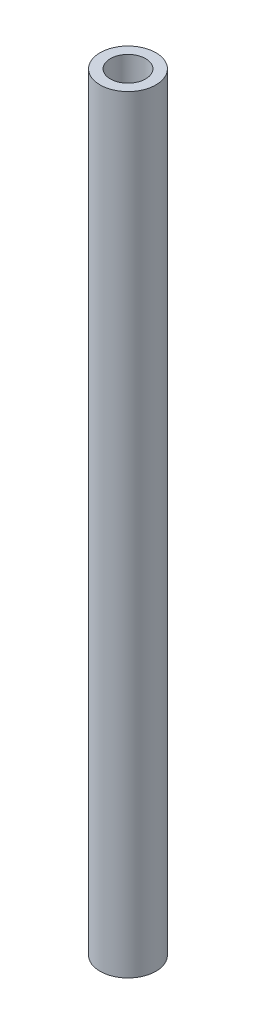
ISO-10303-21;
HEADER;
FILE_DESCRIPTION(('STEP AP214'),'2;1');
FILE_NAME('part.step','',(''),(''),'','','');
FILE_SCHEMA(('AUTOMOTIVE_DESIGN { 1 0 10303 214 1 1 1 1 }'));
ENDSEC;
DATA;
#1=APPLICATION_CONTEXT('core data for automotive mechanical design processes');
#2=APPLICATION_PROTOCOL_DEFINITION('international standard','automotive_design',2000,#1);
#3=PRODUCT_CONTEXT('',#1,'mechanical');
#4=PRODUCT('Part','Part','',(#3));
#5=PRODUCT_RELATED_PRODUCT_CATEGORY('part','',(#4));
#6=PRODUCT_DEFINITION_FORMATION('','',#4);
#7=PRODUCT_DEFINITION_CONTEXT('part definition',#1,'design');
#8=PRODUCT_DEFINITION('design','',#6,#7);
#9=PRODUCT_DEFINITION_SHAPE('','',#8);
#10=(LENGTH_UNIT() NAMED_UNIT(*) SI_UNIT(.MILLI.,.METRE.));
#11=(NAMED_UNIT(*) PLANE_ANGLE_UNIT() SI_UNIT($,.RADIAN.));
#12=(NAMED_UNIT(*) SI_UNIT($,.STERADIAN.) SOLID_ANGLE_UNIT());
#13=UNCERTAINTY_MEASURE_WITH_UNIT(LENGTH_MEASURE(1.E-05),#10,'distance_accuracy_value','');
#14=(GEOMETRIC_REPRESENTATION_CONTEXT(3) GLOBAL_UNCERTAINTY_ASSIGNED_CONTEXT((#13)) GLOBAL_UNIT_ASSIGNED_CONTEXT((#10,
#11,#12)) REPRESENTATION_CONTEXT('',''));
#15=CARTESIAN_POINT('',(0.,0.,0.));
#16=DIRECTION('',(0.,0.,1.));
#17=DIRECTION('',(1.,0.,0.));
#18=AXIS2_PLACEMENT_3D('',#15,#16,#17);
#19=CARTESIAN_POINT('',(0.,-110.,0.));
#20=DIRECTION('',(0.,1.,0.));
#21=DIRECTION('',(0.,0.,1.));
#22=AXIS2_PLACEMENT_3D('',#19,#20,#21);
#23=CYLINDRICAL_SURFACE('',#22,4.);
#24=CARTESIAN_POINT('',(0.,-110.,0.));
#25=DIRECTION('',(0.,1.,0.));
#26=DIRECTION('',(0.,0.,1.));
#27=AXIS2_PLACEMENT_3D('',#24,#25,#26);
#28=CIRCLE('',#27,4.);
#29=CARTESIAN_POINT('',(0.,-110.,4.));
#30=VERTEX_POINT('',#29);
#31=EDGE_CURVE('E13',#30,#30,#28,.T.);
#32=ORIENTED_EDGE('',*,*,#31,.T.);
#33=EDGE_LOOP('',(#32));
#34=FACE_BOUND('',#33,.T.);
#35=CARTESIAN_POINT('',(0.,0.,0.));
#36=DIRECTION('',(0.,1.,0.));
#37=DIRECTION('',(0.,0.,1.));
#38=AXIS2_PLACEMENT_3D('',#35,#36,#37);
#39=CIRCLE('',#38,4.);
#40=CARTESIAN_POINT('',(0.,0.,4.));
#41=VERTEX_POINT('',#40);
#42=EDGE_CURVE('E50',#41,#41,#39,.T.);
#43=ORIENTED_EDGE('',*,*,#42,.F.);
#44=EDGE_LOOP('',(#43));
#45=FACE_BOUND('',#44,.T.);
#46=ADVANCED_FACE('F47',(#34,#45),#23,.T.);
#47=CARTESIAN_POINT('',(0.,-110.,0.));
#48=DIRECTION('',(0.,1.,0.));
#49=DIRECTION('',(0.,0.,1.));
#50=AXIS2_PLACEMENT_3D('',#47,#48,#49);
#51=PLANE('',#50);
#52=CARTESIAN_POINT('',(0.,-110.,0.));
#53=DIRECTION('',(0.,-1.,0.));
#54=DIRECTION('',(0.,0.,-1.));
#55=AXIS2_PLACEMENT_3D('',#52,#53,#54);
#56=CIRCLE('',#55,2.52729999999999);
#57=CARTESIAN_POINT('',(0.,-110.,-2.52729999999999));
#58=VERTEX_POINT('',#57);
#59=EDGE_CURVE('E71',#58,#58,#56,.T.);
#60=ORIENTED_EDGE('',*,*,#59,.F.);
#61=EDGE_LOOP('',(#60));
#62=FACE_BOUND('',#61,.T.);
#63=ORIENTED_EDGE('',*,*,#31,.F.);
#64=EDGE_LOOP('',(#63));
#65=FACE_BOUND('',#64,.T.);
#66=ADVANCED_FACE('F88',(#62,#65),#51,.F.);
#67=CARTESIAN_POINT('',(0.,0.,0.));
#68=DIRECTION('',(0.,1.,0.));
#69=DIRECTION('',(0.,0.,1.));
#70=AXIS2_PLACEMENT_3D('',#67,#68,#69);
#71=PLANE('',#70);
#72=CARTESIAN_POINT('',(0.,0.,0.));
#73=DIRECTION('',(0.,1.,0.));
#74=DIRECTION('',(0.,0.,1.));
#75=AXIS2_PLACEMENT_3D('',#72,#73,#74);
#76=CIRCLE('',#75,2.52729999999999);
#77=CARTESIAN_POINT('',(0.,0.,2.52729999999999));
#78=VERTEX_POINT('',#77);
#79=EDGE_CURVE('E70',#78,#78,#76,.T.);
#80=ORIENTED_EDGE('',*,*,#79,.F.);
#81=EDGE_LOOP('',(#80));
#82=FACE_BOUND('',#81,.T.);
#83=ORIENTED_EDGE('',*,*,#42,.T.);
#84=EDGE_LOOP('',(#83));
#85=FACE_BOUND('',#84,.T.);
#86=ADVANCED_FACE('F85',(#82,#85),#71,.T.);
#87=CARTESIAN_POINT('',(0.,-9.99999999999999,0.));
#88=DIRECTION('',(0.,1.,0.));
#89=DIRECTION('',(0.,0.,1.));
#90=AXIS2_PLACEMENT_3D('',#87,#88,#89);
#91=CONICAL_SURFACE('',#90,2.52729999999999,1.02974425867665);
#92=CARTESIAN_POINT('',(0.,-11.5185550424684,0.));
#93=VERTEX_POINT('',#92);
#94=VERTEX_LOOP('',#93);
#95=FACE_BOUND('',#94,.T.);
#96=CARTESIAN_POINT('',(0.,-9.99999999999999,0.));
#97=DIRECTION('',(0.,1.,0.));
#98=DIRECTION('',(0.,0.,1.));
#99=AXIS2_PLACEMENT_3D('',#96,#97,#98);
#100=CIRCLE('',#99,2.52729999999999);
#101=CARTESIAN_POINT('',(0.,-9.99999999999999,2.52729999999999));
#102=VERTEX_POINT('',#101);
#103=EDGE_CURVE('E74',#102,#102,#100,.T.);
#104=ORIENTED_EDGE('',*,*,#103,.T.);
#105=EDGE_LOOP('',(#104));
#106=FACE_BOUND('',#105,.T.);
#107=ADVANCED_FACE('F100',(#95,#106),#91,.F.);
#108=CARTESIAN_POINT('',(0.,0.,0.));
#109=DIRECTION('',(0.,1.,0.));
#110=DIRECTION('',(0.,0.,1.));
#111=AXIS2_PLACEMENT_3D('',#108,#109,#110);
#112=CYLINDRICAL_SURFACE('',#111,2.52729999999999);
#113=ORIENTED_EDGE('',*,*,#103,.F.);
#114=EDGE_LOOP('',(#113));
#115=FACE_BOUND('',#114,.T.);
#116=ORIENTED_EDGE('',*,*,#79,.T.);
#117=EDGE_LOOP('',(#116));
#118=FACE_BOUND('',#117,.T.);
#119=ADVANCED_FACE('F64',(#115,#118),#112,.F.);
#120=CARTESIAN_POINT('',(0.,-100.,0.));
#121=DIRECTION('',(0.,-1.,0.));
#122=DIRECTION('',(0.,0.,-1.));
#123=AXIS2_PLACEMENT_3D('',#120,#121,#122);
#124=CONICAL_SURFACE('',#123,2.52729999999999,1.02974425867665);
#125=CARTESIAN_POINT('',(0.,-98.4814449575317,0.));
#126=VERTEX_POINT('',#125);
#127=VERTEX_LOOP('',#126);
#128=FACE_BOUND('',#127,.T.);
#129=CARTESIAN_POINT('',(0.,-100.,0.));
#130=DIRECTION('',(0.,-1.,0.));
#131=DIRECTION('',(0.,0.,-1.));
#132=AXIS2_PLACEMENT_3D('',#129,#130,#131);
#133=CIRCLE('',#132,2.52729999999999);
#134=CARTESIAN_POINT('',(0.,-100.,-2.52729999999999));
#135=VERTEX_POINT('',#134);
#136=EDGE_CURVE('E68',#135,#135,#133,.T.);
#137=ORIENTED_EDGE('',*,*,#136,.T.);
#138=EDGE_LOOP('',(#137));
#139=FACE_BOUND('',#138,.T.);
#140=ADVANCED_FACE('F60',(#128,#139),#124,.F.);
#141=CARTESIAN_POINT('',(0.,-110.,0.));
#142=DIRECTION('',(0.,-1.,0.));
#143=DIRECTION('',(0.,0.,-1.));
#144=AXIS2_PLACEMENT_3D('',#141,#142,#143);
#145=CYLINDRICAL_SURFACE('',#144,2.52729999999999);
#146=ORIENTED_EDGE('',*,*,#136,.F.);
#147=EDGE_LOOP('',(#146));
#148=FACE_BOUND('',#147,.T.);
#149=ORIENTED_EDGE('',*,*,#59,.T.);
#150=EDGE_LOOP('',(#149));
#151=FACE_BOUND('',#150,.T.);
#152=ADVANCED_FACE('F63',(#148,#151),#145,.F.);
#153=CLOSED_SHELL('',(#46,#66,#86,#107,#119,#140,#152));
#154=MANIFOLD_SOLID_BREP('B2',#153);
#155=ADVANCED_BREP_SHAPE_REPRESENTATION('',(#18,#154),#14);
#156=SHAPE_DEFINITION_REPRESENTATION(#9,#155);
ENDSEC;
END-ISO-10303-21;
